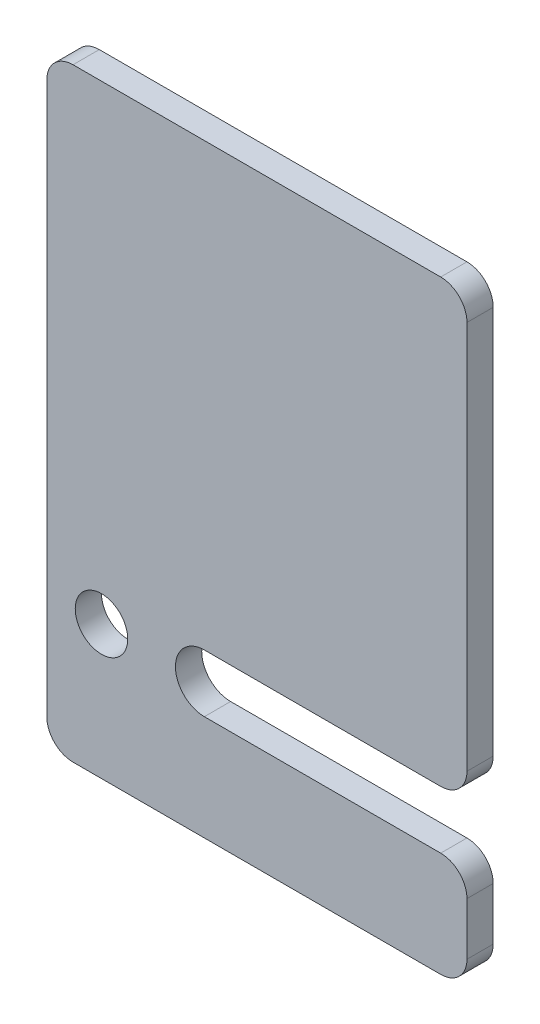
ISO-10303-21;
HEADER;
FILE_DESCRIPTION(('STEP AP214'),'2;1');
FILE_NAME('part.step','',(''),(''),'','','');
FILE_SCHEMA(('AUTOMOTIVE_DESIGN { 1 0 10303 214 1 1 1 1 }'));
ENDSEC;
DATA;
#1=APPLICATION_CONTEXT('core data for automotive mechanical design processes');
#2=APPLICATION_PROTOCOL_DEFINITION('international standard','automotive_design',2000,#1);
#3=PRODUCT_CONTEXT('',#1,'mechanical');
#4=PRODUCT('Part','Part','',(#3));
#5=PRODUCT_RELATED_PRODUCT_CATEGORY('part','',(#4));
#6=PRODUCT_DEFINITION_FORMATION('','',#4);
#7=PRODUCT_DEFINITION_CONTEXT('part definition',#1,'design');
#8=PRODUCT_DEFINITION('design','',#6,#7);
#9=PRODUCT_DEFINITION_SHAPE('','',#8);
#10=(LENGTH_UNIT() NAMED_UNIT(*) SI_UNIT(.MILLI.,.METRE.));
#11=(NAMED_UNIT(*) PLANE_ANGLE_UNIT() SI_UNIT($,.RADIAN.));
#12=(NAMED_UNIT(*) SI_UNIT($,.STERADIAN.) SOLID_ANGLE_UNIT());
#13=UNCERTAINTY_MEASURE_WITH_UNIT(LENGTH_MEASURE(1.E-05),#10,'distance_accuracy_value','');
#14=(GEOMETRIC_REPRESENTATION_CONTEXT(3) GLOBAL_UNCERTAINTY_ASSIGNED_CONTEXT((#13)) GLOBAL_UNIT_ASSIGNED_CONTEXT((#10,
#11,#12)) REPRESENTATION_CONTEXT('',''));
#15=CARTESIAN_POINT('',(0.,0.,0.));
#16=DIRECTION('',(0.,0.,1.));
#17=DIRECTION('',(1.,0.,0.));
#18=AXIS2_PLACEMENT_3D('',#15,#16,#17);
#19=CARTESIAN_POINT('',(75.,15.,5.));
#20=DIRECTION('',(0.,0.,-1.));
#21=DIRECTION('',(-1.,0.,0.));
#22=AXIS2_PLACEMENT_3D('',#19,#20,#21);
#23=CYLINDRICAL_SURFACE('',#22,5.);
#24=CARTESIAN_POINT('',(75.,15.,0.));
#25=DIRECTION('',(0.,0.,1.));
#26=DIRECTION('',(-1.,0.,0.));
#27=AXIS2_PLACEMENT_3D('',#24,#25,#26);
#28=CIRCLE('',#27,5.);
#29=CARTESIAN_POINT('',(80.,15.,0.));
#30=VERTEX_POINT('',#29);
#31=CARTESIAN_POINT('',(75.,20.,0.));
#32=VERTEX_POINT('',#31);
#33=EDGE_CURVE('E165',#30,#32,#28,.T.);
#34=ORIENTED_EDGE('',*,*,#33,.T.);
#35=DIRECTION('',(0.,0.,-1.));
#36=VECTOR('',#35,1.);
#37=CARTESIAN_POINT('',(75.,20.,5.));
#38=LINE('',#37,#36);
#39=CARTESIAN_POINT('',(75.,20.,5.));
#40=VERTEX_POINT('',#39);
#41=EDGE_CURVE('E11',#40,#32,#38,.T.);
#42=ORIENTED_EDGE('',*,*,#41,.F.);
#43=CARTESIAN_POINT('',(75.,15.,5.));
#44=DIRECTION('',(0.,0.,1.));
#45=DIRECTION('',(-1.,0.,0.));
#46=AXIS2_PLACEMENT_3D('',#43,#44,#45);
#47=CIRCLE('',#46,5.);
#48=CARTESIAN_POINT('',(80.,15.,5.));
#49=VERTEX_POINT('',#48);
#50=EDGE_CURVE('E192',#49,#40,#47,.T.);
#51=ORIENTED_EDGE('',*,*,#50,.F.);
#52=DIRECTION('',(0.,0.,-1.));
#53=VECTOR('',#52,1.);
#54=CARTESIAN_POINT('',(80.,15.,5.));
#55=LINE('',#54,#53);
#56=EDGE_CURVE('E161',#49,#30,#55,.T.);
#57=ORIENTED_EDGE('',*,*,#56,.T.);
#58=EDGE_LOOP('',(#34,#42,#51,#57));
#59=FACE_BOUND('',#58,.T.);
#60=ADVANCED_FACE('F33',(#59),#23,.T.);
#61=CARTESIAN_POINT('',(30.,20.,5.));
#62=DIRECTION('',(0.,-1.,0.));
#63=DIRECTION('',(0.,0.,-1.));
#64=AXIS2_PLACEMENT_3D('',#61,#62,#63);
#65=PLANE('',#64);
#66=DIRECTION('',(-1.,0.,0.));
#67=VECTOR('',#66,1.);
#68=CARTESIAN_POINT('',(30.,20.,0.));
#69=LINE('',#68,#67);
#70=CARTESIAN_POINT('',(30.,20.,0.));
#71=VERTEX_POINT('',#70);
#72=EDGE_CURVE('E168',#32,#71,#69,.T.);
#73=ORIENTED_EDGE('',*,*,#72,.T.);
#74=DIRECTION('',(0.,0.,-1.));
#75=VECTOR('',#74,1.);
#76=CARTESIAN_POINT('',(30.,20.,5.));
#77=LINE('',#76,#75);
#78=CARTESIAN_POINT('',(30.,20.,5.));
#79=VERTEX_POINT('',#78);
#80=EDGE_CURVE('E41',#79,#71,#77,.T.);
#81=ORIENTED_EDGE('',*,*,#80,.F.);
#82=DIRECTION('',(-1.,0.,0.));
#83=VECTOR('',#82,1.);
#84=CARTESIAN_POINT('',(30.,20.,5.));
#85=LINE('',#84,#83);
#86=EDGE_CURVE('E110',#40,#79,#85,.T.);
#87=ORIENTED_EDGE('',*,*,#86,.F.);
#88=ORIENTED_EDGE('',*,*,#41,.T.);
#89=EDGE_LOOP('',(#73,#81,#87,#88));
#90=FACE_BOUND('',#89,.T.);
#91=ADVANCED_FACE('F281',(#90),#65,.F.);
#92=CARTESIAN_POINT('',(30.,25.5,5.));
#93=DIRECTION('',(0.,0.,-1.));
#94=DIRECTION('',(-1.,0.,0.));
#95=AXIS2_PLACEMENT_3D('',#92,#93,#94);
#96=CYLINDRICAL_SURFACE('',#95,5.5);
#97=CARTESIAN_POINT('',(30.,25.5,0.));
#98=DIRECTION('',(0.,0.,-1.));
#99=DIRECTION('',(1.,0.,0.));
#100=AXIS2_PLACEMENT_3D('',#97,#98,#99);
#101=CIRCLE('',#100,5.5);
#102=CARTESIAN_POINT('',(30.,31.,0.));
#103=VERTEX_POINT('',#102);
#104=EDGE_CURVE('E171',#71,#103,#101,.T.);
#105=ORIENTED_EDGE('',*,*,#104,.T.);
#106=DIRECTION('',(0.,0.,-1.));
#107=VECTOR('',#106,1.);
#108=CARTESIAN_POINT('',(30.,31.,5.));
#109=LINE('',#108,#107);
#110=CARTESIAN_POINT('',(30.,31.,5.));
#111=VERTEX_POINT('',#110);
#112=EDGE_CURVE('E217',#111,#103,#109,.T.);
#113=ORIENTED_EDGE('',*,*,#112,.F.);
#114=CARTESIAN_POINT('',(30.,25.5,5.));
#115=DIRECTION('',(0.,0.,-1.));
#116=DIRECTION('',(1.,0.,0.));
#117=AXIS2_PLACEMENT_3D('',#114,#115,#116);
#118=CIRCLE('',#117,5.5);
#119=EDGE_CURVE('E225',#79,#111,#118,.T.);
#120=ORIENTED_EDGE('',*,*,#119,.F.);
#121=ORIENTED_EDGE('',*,*,#80,.T.);
#122=EDGE_LOOP('',(#105,#113,#120,#121));
#123=FACE_BOUND('',#122,.T.);
#124=ADVANCED_FACE('F223',(#123),#96,.F.);
#125=CARTESIAN_POINT('',(75.,31.,5.));
#126=DIRECTION('',(0.,1.,0.));
#127=DIRECTION('',(-1.,0.,0.));
#128=AXIS2_PLACEMENT_3D('',#125,#126,#127);
#129=PLANE('',#128);
#130=DIRECTION('',(1.,0.,0.));
#131=VECTOR('',#130,1.);
#132=CARTESIAN_POINT('',(75.,31.,0.));
#133=LINE('',#132,#131);
#134=CARTESIAN_POINT('',(75.,31.,0.));
#135=VERTEX_POINT('',#134);
#136=EDGE_CURVE('E173',#103,#135,#133,.T.);
#137=ORIENTED_EDGE('',*,*,#136,.T.);
#138=DIRECTION('',(0.,0.,-1.));
#139=VECTOR('',#138,1.);
#140=CARTESIAN_POINT('',(75.,31.,5.));
#141=LINE('',#140,#139);
#142=CARTESIAN_POINT('',(75.,31.,5.));
#143=VERTEX_POINT('',#142);
#144=EDGE_CURVE('E214',#143,#135,#141,.T.);
#145=ORIENTED_EDGE('',*,*,#144,.F.);
#146=DIRECTION('',(1.,0.,0.));
#147=VECTOR('',#146,1.);
#148=CARTESIAN_POINT('',(75.,31.,5.));
#149=LINE('',#148,#147);
#150=EDGE_CURVE('E243',#111,#143,#149,.T.);
#151=ORIENTED_EDGE('',*,*,#150,.F.);
#152=ORIENTED_EDGE('',*,*,#112,.T.);
#153=EDGE_LOOP('',(#137,#145,#151,#152));
#154=FACE_BOUND('',#153,.T.);
#155=ADVANCED_FACE('F234',(#154),#129,.F.);
#156=CARTESIAN_POINT('',(75.,36.,5.));
#157=DIRECTION('',(0.,0.,-1.));
#158=DIRECTION('',(-1.,0.,0.));
#159=AXIS2_PLACEMENT_3D('',#156,#157,#158);
#160=CYLINDRICAL_SURFACE('',#159,5.00000000000001);
#161=CARTESIAN_POINT('',(75.,36.,0.));
#162=DIRECTION('',(0.,0.,1.));
#163=DIRECTION('',(1.,0.,0.));
#164=AXIS2_PLACEMENT_3D('',#161,#162,#163);
#165=CIRCLE('',#164,5.00000000000001);
#166=CARTESIAN_POINT('',(80.,36.,0.));
#167=VERTEX_POINT('',#166);
#168=EDGE_CURVE('E175',#135,#167,#165,.T.);
#169=ORIENTED_EDGE('',*,*,#168,.T.);
#170=DIRECTION('',(0.,0.,-1.));
#171=VECTOR('',#170,1.);
#172=CARTESIAN_POINT('',(80.,36.,5.));
#173=LINE('',#172,#171);
#174=CARTESIAN_POINT('',(80.,36.,5.));
#175=VERTEX_POINT('',#174);
#176=EDGE_CURVE('E211',#175,#167,#173,.T.);
#177=ORIENTED_EDGE('',*,*,#176,.F.);
#178=CARTESIAN_POINT('',(75.,36.,5.));
#179=DIRECTION('',(0.,0.,1.));
#180=DIRECTION('',(1.,0.,0.));
#181=AXIS2_PLACEMENT_3D('',#178,#179,#180);
#182=CIRCLE('',#181,5.00000000000001);
#183=EDGE_CURVE('E240',#143,#175,#182,.T.);
#184=ORIENTED_EDGE('',*,*,#183,.F.);
#185=ORIENTED_EDGE('',*,*,#144,.T.);
#186=EDGE_LOOP('',(#169,#177,#184,#185));
#187=FACE_BOUND('',#186,.T.);
#188=ADVANCED_FACE('F238',(#187),#160,.T.);
#189=CARTESIAN_POINT('',(80.,110.,5.));
#190=DIRECTION('',(-1.,0.,0.));
#191=DIRECTION('',(0.,-1.,0.));
#192=AXIS2_PLACEMENT_3D('',#189,#190,#191);
#193=PLANE('',#192);
#194=DIRECTION('',(0.,1.,0.));
#195=VECTOR('',#194,1.);
#196=CARTESIAN_POINT('',(80.,110.,0.));
#197=LINE('',#196,#195);
#198=CARTESIAN_POINT('',(80.,110.,0.));
#199=VERTEX_POINT('',#198);
#200=EDGE_CURVE('E177',#167,#199,#197,.T.);
#201=ORIENTED_EDGE('',*,*,#200,.T.);
#202=DIRECTION('',(0.,0.,-1.));
#203=VECTOR('',#202,1.);
#204=CARTESIAN_POINT('',(80.,110.,5.));
#205=LINE('',#204,#203);
#206=CARTESIAN_POINT('',(80.,110.,5.));
#207=VERTEX_POINT('',#206);
#208=EDGE_CURVE('E208',#207,#199,#205,.T.);
#209=ORIENTED_EDGE('',*,*,#208,.F.);
#210=DIRECTION('',(0.,1.,0.));
#211=VECTOR('',#210,1.);
#212=CARTESIAN_POINT('',(80.,110.,5.));
#213=LINE('',#212,#211);
#214=EDGE_CURVE('E242',#175,#207,#213,.T.);
#215=ORIENTED_EDGE('',*,*,#214,.F.);
#216=ORIENTED_EDGE('',*,*,#176,.T.);
#217=EDGE_LOOP('',(#201,#209,#215,#216));
#218=FACE_BOUND('',#217,.T.);
#219=ADVANCED_FACE('F294',(#218),#193,.F.);
#220=CARTESIAN_POINT('',(75.,110.,5.));
#221=DIRECTION('',(0.,0.,-1.));
#222=DIRECTION('',(-1.,0.,0.));
#223=AXIS2_PLACEMENT_3D('',#220,#221,#222);
#224=CYLINDRICAL_SURFACE('',#223,5.);
#225=CARTESIAN_POINT('',(75.,110.,0.));
#226=DIRECTION('',(0.,0.,1.));
#227=DIRECTION('',(-1.,0.,0.));
#228=AXIS2_PLACEMENT_3D('',#225,#226,#227);
#229=CIRCLE('',#228,5.);
#230=CARTESIAN_POINT('',(75.,115.,0.));
#231=VERTEX_POINT('',#230);
#232=EDGE_CURVE('E179',#199,#231,#229,.T.);
#233=ORIENTED_EDGE('',*,*,#232,.T.);
#234=DIRECTION('',(0.,0.,-1.));
#235=VECTOR('',#234,1.);
#236=CARTESIAN_POINT('',(75.,115.,5.));
#237=LINE('',#236,#235);
#238=CARTESIAN_POINT('',(75.,115.,5.));
#239=VERTEX_POINT('',#238);
#240=EDGE_CURVE('E205',#239,#231,#237,.T.);
#241=ORIENTED_EDGE('',*,*,#240,.F.);
#242=CARTESIAN_POINT('',(75.,110.,5.));
#243=DIRECTION('',(0.,0.,1.));
#244=DIRECTION('',(-1.,0.,0.));
#245=AXIS2_PLACEMENT_3D('',#242,#243,#244);
#246=CIRCLE('',#245,5.);
#247=EDGE_CURVE('E245',#207,#239,#246,.T.);
#248=ORIENTED_EDGE('',*,*,#247,.F.);
#249=ORIENTED_EDGE('',*,*,#208,.T.);
#250=EDGE_LOOP('',(#233,#241,#248,#249));
#251=FACE_BOUND('',#250,.T.);
#252=ADVANCED_FACE('F297',(#251),#224,.T.);
#253=CARTESIAN_POINT('',(5.00000000000004,115.,5.));
#254=DIRECTION('',(0.,-1.,0.));
#255=DIRECTION('',(0.,0.,-1.));
#256=AXIS2_PLACEMENT_3D('',#253,#254,#255);
#257=PLANE('',#256);
#258=DIRECTION('',(-1.,0.,0.));
#259=VECTOR('',#258,1.);
#260=CARTESIAN_POINT('',(5.00000000000004,115.,0.));
#261=LINE('',#260,#259);
#262=CARTESIAN_POINT('',(5.00000000000004,115.,0.));
#263=VERTEX_POINT('',#262);
#264=EDGE_CURVE('E181',#231,#263,#261,.T.);
#265=ORIENTED_EDGE('',*,*,#264,.T.);
#266=DIRECTION('',(0.,0.,-1.));
#267=VECTOR('',#266,1.);
#268=CARTESIAN_POINT('',(5.00000000000004,115.,5.));
#269=LINE('',#268,#267);
#270=CARTESIAN_POINT('',(5.00000000000004,115.,5.));
#271=VERTEX_POINT('',#270);
#272=EDGE_CURVE('E202',#271,#263,#269,.T.);
#273=ORIENTED_EDGE('',*,*,#272,.F.);
#274=DIRECTION('',(-1.,0.,0.));
#275=VECTOR('',#274,1.);
#276=CARTESIAN_POINT('',(5.00000000000004,115.,5.));
#277=LINE('',#276,#275);
#278=EDGE_CURVE('E251',#239,#271,#277,.T.);
#279=ORIENTED_EDGE('',*,*,#278,.F.);
#280=ORIENTED_EDGE('',*,*,#240,.T.);
#281=EDGE_LOOP('',(#265,#273,#279,#280));
#282=FACE_BOUND('',#281,.T.);
#283=ADVANCED_FACE('F301',(#282),#257,.F.);
#284=CARTESIAN_POINT('',(5.,110.,5.));
#285=DIRECTION('',(0.,0.,-1.));
#286=DIRECTION('',(-1.,0.,0.));
#287=AXIS2_PLACEMENT_3D('',#284,#285,#286);
#288=CYLINDRICAL_SURFACE('',#287,5.);
#289=CARTESIAN_POINT('',(5.,110.,0.));
#290=DIRECTION('',(0.,0.,1.));
#291=DIRECTION('',(-1.,0.,0.));
#292=AXIS2_PLACEMENT_3D('',#289,#290,#291);
#293=CIRCLE('',#292,5.);
#294=CARTESIAN_POINT('',(0.,110.,0.));
#295=VERTEX_POINT('',#294);
#296=EDGE_CURVE('E183',#263,#295,#293,.T.);
#297=ORIENTED_EDGE('',*,*,#296,.T.);
#298=DIRECTION('',(0.,0.,-1.));
#299=VECTOR('',#298,1.);
#300=CARTESIAN_POINT('',(0.,110.,5.));
#301=LINE('',#300,#299);
#302=CARTESIAN_POINT('',(0.,110.,5.));
#303=VERTEX_POINT('',#302);
#304=EDGE_CURVE('E199',#303,#295,#301,.T.);
#305=ORIENTED_EDGE('',*,*,#304,.F.);
#306=CARTESIAN_POINT('',(5.,110.,5.));
#307=DIRECTION('',(0.,0.,1.));
#308=DIRECTION('',(-1.,0.,0.));
#309=AXIS2_PLACEMENT_3D('',#306,#307,#308);
#310=CIRCLE('',#309,5.);
#311=EDGE_CURVE('E253',#271,#303,#310,.T.);
#312=ORIENTED_EDGE('',*,*,#311,.F.);
#313=ORIENTED_EDGE('',*,*,#272,.T.);
#314=EDGE_LOOP('',(#297,#305,#312,#313));
#315=FACE_BOUND('',#314,.T.);
#316=ADVANCED_FACE('F305',(#315),#288,.T.);
#317=CARTESIAN_POINT('',(0.,5.00000000000004,5.));
#318=DIRECTION('',(1.,0.,0.));
#319=DIRECTION('',(0.,0.,-1.));
#320=AXIS2_PLACEMENT_3D('',#317,#318,#319);
#321=PLANE('',#320);
#322=DIRECTION('',(0.,-1.,0.));
#323=VECTOR('',#322,1.);
#324=CARTESIAN_POINT('',(0.,5.00000000000004,0.));
#325=LINE('',#324,#323);
#326=CARTESIAN_POINT('',(0.,5.00000000000004,0.));
#327=VERTEX_POINT('',#326);
#328=EDGE_CURVE('E185',#295,#327,#325,.T.);
#329=ORIENTED_EDGE('',*,*,#328,.T.);
#330=DIRECTION('',(0.,0.,-1.));
#331=VECTOR('',#330,1.);
#332=CARTESIAN_POINT('',(0.,5.00000000000004,5.));
#333=LINE('',#332,#331);
#334=CARTESIAN_POINT('',(0.,5.00000000000004,5.));
#335=VERTEX_POINT('',#334);
#336=EDGE_CURVE('E196',#335,#327,#333,.T.);
#337=ORIENTED_EDGE('',*,*,#336,.F.);
#338=DIRECTION('',(0.,-1.,0.));
#339=VECTOR('',#338,1.);
#340=CARTESIAN_POINT('',(0.,5.00000000000004,5.));
#341=LINE('',#340,#339);
#342=EDGE_CURVE('E255',#303,#335,#341,.T.);
#343=ORIENTED_EDGE('',*,*,#342,.F.);
#344=ORIENTED_EDGE('',*,*,#304,.T.);
#345=EDGE_LOOP('',(#329,#337,#343,#344));
#346=FACE_BOUND('',#345,.T.);
#347=ADVANCED_FACE('F261',(#346),#321,.F.);
#348=CARTESIAN_POINT('',(5.,5.,5.));
#349=DIRECTION('',(0.,0.,-1.));
#350=DIRECTION('',(-1.,0.,0.));
#351=AXIS2_PLACEMENT_3D('',#348,#349,#350);
#352=CYLINDRICAL_SURFACE('',#351,5.);
#353=CARTESIAN_POINT('',(5.,5.,0.));
#354=DIRECTION('',(0.,0.,1.));
#355=DIRECTION('',(-1.,0.,0.));
#356=AXIS2_PLACEMENT_3D('',#353,#354,#355);
#357=CIRCLE('',#356,5.);
#358=CARTESIAN_POINT('',(5.00000000000004,0.,0.));
#359=VERTEX_POINT('',#358);
#360=EDGE_CURVE('E187',#327,#359,#357,.T.);
#361=ORIENTED_EDGE('',*,*,#360,.T.);
#362=DIRECTION('',(0.,0.,-1.));
#363=VECTOR('',#362,1.);
#364=CARTESIAN_POINT('',(5.00000000000004,0.,5.));
#365=LINE('',#364,#363);
#366=CARTESIAN_POINT('',(5.00000000000004,0.,5.));
#367=VERTEX_POINT('',#366);
#368=EDGE_CURVE('E156',#367,#359,#365,.T.);
#369=ORIENTED_EDGE('',*,*,#368,.F.);
#370=CARTESIAN_POINT('',(5.,5.,5.));
#371=DIRECTION('',(0.,0.,1.));
#372=DIRECTION('',(-1.,0.,0.));
#373=AXIS2_PLACEMENT_3D('',#370,#371,#372);
#374=CIRCLE('',#373,5.);
#375=EDGE_CURVE('E147',#335,#367,#374,.T.);
#376=ORIENTED_EDGE('',*,*,#375,.F.);
#377=ORIENTED_EDGE('',*,*,#336,.T.);
#378=EDGE_LOOP('',(#361,#369,#376,#377));
#379=FACE_BOUND('',#378,.T.);
#380=ADVANCED_FACE('F265',(#379),#352,.T.);
#381=CARTESIAN_POINT('',(5.00000000000004,0.,5.));
#382=DIRECTION('',(0.,1.,0.));
#383=DIRECTION('',(0.,0.,1.));
#384=AXIS2_PLACEMENT_3D('',#381,#382,#383);
#385=PLANE('',#384);
#386=DIRECTION('',(1.,0.,0.));
#387=VECTOR('',#386,1.);
#388=CARTESIAN_POINT('',(5.00000000000004,0.,0.));
#389=LINE('',#388,#387);
#390=CARTESIAN_POINT('',(75.,0.,0.));
#391=VERTEX_POINT('',#390);
#392=EDGE_CURVE('E155',#359,#391,#389,.T.);
#393=ORIENTED_EDGE('',*,*,#392,.T.);
#394=DIRECTION('',(0.,0.,-1.));
#395=VECTOR('',#394,1.);
#396=CARTESIAN_POINT('',(75.,0.,5.));
#397=LINE('',#396,#395);
#398=CARTESIAN_POINT('',(75.,0.,5.));
#399=VERTEX_POINT('',#398);
#400=EDGE_CURVE('E152',#399,#391,#397,.T.);
#401=ORIENTED_EDGE('',*,*,#400,.F.);
#402=DIRECTION('',(1.,0.,0.));
#403=VECTOR('',#402,1.);
#404=CARTESIAN_POINT('',(5.00000000000004,0.,5.));
#405=LINE('',#404,#403);
#406=EDGE_CURVE('E141',#367,#399,#405,.T.);
#407=ORIENTED_EDGE('',*,*,#406,.F.);
#408=ORIENTED_EDGE('',*,*,#368,.T.);
#409=EDGE_LOOP('',(#393,#401,#407,#408));
#410=FACE_BOUND('',#409,.T.);
#411=ADVANCED_FACE('F153',(#410),#385,.F.);
#412=CARTESIAN_POINT('',(75.,5.,5.));
#413=DIRECTION('',(0.,0.,-1.));
#414=DIRECTION('',(-1.,0.,0.));
#415=AXIS2_PLACEMENT_3D('',#412,#413,#414);
#416=CYLINDRICAL_SURFACE('',#415,5.);
#417=CARTESIAN_POINT('',(75.,5.,0.));
#418=DIRECTION('',(0.,0.,1.));
#419=DIRECTION('',(-1.,0.,0.));
#420=AXIS2_PLACEMENT_3D('',#417,#418,#419);
#421=CIRCLE('',#420,5.);
#422=CARTESIAN_POINT('',(80.,5.00000000000004,0.));
#423=VERTEX_POINT('',#422);
#424=EDGE_CURVE('E96',#391,#423,#421,.T.);
#425=ORIENTED_EDGE('',*,*,#424,.T.);
#426=DIRECTION('',(0.,0.,-1.));
#427=VECTOR('',#426,1.);
#428=CARTESIAN_POINT('',(80.,5.00000000000004,5.));
#429=LINE('',#428,#427);
#430=CARTESIAN_POINT('',(80.,5.00000000000004,5.));
#431=VERTEX_POINT('',#430);
#432=EDGE_CURVE('E157',#431,#423,#429,.T.);
#433=ORIENTED_EDGE('',*,*,#432,.F.);
#434=CARTESIAN_POINT('',(75.,5.,5.));
#435=DIRECTION('',(0.,0.,1.));
#436=DIRECTION('',(-1.,0.,0.));
#437=AXIS2_PLACEMENT_3D('',#434,#435,#436);
#438=CIRCLE('',#437,5.);
#439=EDGE_CURVE('E145',#399,#431,#438,.T.);
#440=ORIENTED_EDGE('',*,*,#439,.F.);
#441=ORIENTED_EDGE('',*,*,#400,.T.);
#442=EDGE_LOOP('',(#425,#433,#440,#441));
#443=FACE_BOUND('',#442,.T.);
#444=ADVANCED_FACE('F159',(#443),#416,.T.);
#445=CARTESIAN_POINT('',(80.,15.,5.));
#446=DIRECTION('',(-1.,0.,0.));
#447=DIRECTION('',(0.,0.,1.));
#448=AXIS2_PLACEMENT_3D('',#445,#446,#447);
#449=PLANE('',#448);
#450=DIRECTION('',(0.,1.,0.));
#451=VECTOR('',#450,1.);
#452=CARTESIAN_POINT('',(80.,15.,0.));
#453=LINE('',#452,#451);
#454=EDGE_CURVE('E102',#423,#30,#453,.T.);
#455=ORIENTED_EDGE('',*,*,#454,.T.);
#456=ORIENTED_EDGE('',*,*,#56,.F.);
#457=DIRECTION('',(0.,1.,0.));
#458=VECTOR('',#457,1.);
#459=CARTESIAN_POINT('',(80.,15.,5.));
#460=LINE('',#459,#458);
#461=EDGE_CURVE('E49',#431,#49,#460,.T.);
#462=ORIENTED_EDGE('',*,*,#461,.F.);
#463=ORIENTED_EDGE('',*,*,#432,.T.);
#464=EDGE_LOOP('',(#455,#456,#462,#463));
#465=FACE_BOUND('',#464,.T.);
#466=ADVANCED_FACE('F269',(#465),#449,.F.);
#467=CARTESIAN_POINT('',(75.,15.,5.));
#468=DIRECTION('',(0.,0.,-1.));
#469=DIRECTION('',(-1.,0.,0.));
#470=AXIS2_PLACEMENT_3D('',#467,#468,#469);
#471=PLANE('',#470);
#472=CARTESIAN_POINT('',(10.4158271136403,25.5,5.));
#473=DIRECTION('',(0.,0.,-1.));
#474=DIRECTION('',(-1.,0.,0.));
#475=AXIS2_PLACEMENT_3D('',#472,#473,#474);
#476=CIRCLE('',#475,5.);
#477=CARTESIAN_POINT('',(5.41582711364031,25.5,5.));
#478=VERTEX_POINT('',#477);
#479=EDGE_CURVE('E169',#478,#478,#476,.T.);
#480=ORIENTED_EDGE('',*,*,#479,.T.);
#481=EDGE_LOOP('',(#480));
#482=FACE_BOUND('',#481,.T.);
#483=ORIENTED_EDGE('',*,*,#50,.T.);
#484=ORIENTED_EDGE('',*,*,#86,.T.);
#485=ORIENTED_EDGE('',*,*,#119,.T.);
#486=ORIENTED_EDGE('',*,*,#150,.T.);
#487=ORIENTED_EDGE('',*,*,#183,.T.);
#488=ORIENTED_EDGE('',*,*,#214,.T.);
#489=ORIENTED_EDGE('',*,*,#247,.T.);
#490=ORIENTED_EDGE('',*,*,#278,.T.);
#491=ORIENTED_EDGE('',*,*,#311,.T.);
#492=ORIENTED_EDGE('',*,*,#342,.T.);
#493=ORIENTED_EDGE('',*,*,#375,.T.);
#494=ORIENTED_EDGE('',*,*,#406,.T.);
#495=ORIENTED_EDGE('',*,*,#439,.T.);
#496=ORIENTED_EDGE('',*,*,#461,.T.);
#497=EDGE_LOOP('',(#483,#484,#485,#486,#487,#488,#489,#490,#491,#492,#493,#494,#495,#496));
#498=FACE_BOUND('',#497,.T.);
#499=ADVANCED_FACE('F143',(#482,#498),#471,.F.);
#500=CARTESIAN_POINT('',(75.,15.,0.));
#501=DIRECTION('',(0.,0.,-1.));
#502=DIRECTION('',(-1.,0.,0.));
#503=AXIS2_PLACEMENT_3D('',#500,#501,#502);
#504=PLANE('',#503);
#505=CARTESIAN_POINT('',(10.4158271136403,25.5,0.));
#506=DIRECTION('',(0.,0.,-1.));
#507=DIRECTION('',(-1.,0.,0.));
#508=AXIS2_PLACEMENT_3D('',#505,#506,#507);
#509=CIRCLE('',#508,5.);
#510=CARTESIAN_POINT('',(5.41582711364031,25.5,0.));
#511=VERTEX_POINT('',#510);
#512=EDGE_CURVE('E358',#511,#511,#509,.T.);
#513=ORIENTED_EDGE('',*,*,#512,.F.);
#514=EDGE_LOOP('',(#513));
#515=FACE_BOUND('',#514,.T.);
#516=ORIENTED_EDGE('',*,*,#33,.F.);
#517=ORIENTED_EDGE('',*,*,#454,.F.);
#518=ORIENTED_EDGE('',*,*,#424,.F.);
#519=ORIENTED_EDGE('',*,*,#392,.F.);
#520=ORIENTED_EDGE('',*,*,#360,.F.);
#521=ORIENTED_EDGE('',*,*,#328,.F.);
#522=ORIENTED_EDGE('',*,*,#296,.F.);
#523=ORIENTED_EDGE('',*,*,#264,.F.);
#524=ORIENTED_EDGE('',*,*,#232,.F.);
#525=ORIENTED_EDGE('',*,*,#200,.F.);
#526=ORIENTED_EDGE('',*,*,#168,.F.);
#527=ORIENTED_EDGE('',*,*,#136,.F.);
#528=ORIENTED_EDGE('',*,*,#104,.F.);
#529=ORIENTED_EDGE('',*,*,#72,.F.);
#530=EDGE_LOOP('',(#516,#517,#518,#519,#520,#521,#522,#523,#524,#525,#526,#527,#528,#529));
#531=FACE_BOUND('',#530,.T.);
#532=ADVANCED_FACE('F229',(#515,#531),#504,.T.);
#533=CARTESIAN_POINT('',(10.4158271136403,25.5,10.));
#534=DIRECTION('',(0.,0.,-1.));
#535=DIRECTION('',(-1.,0.,0.));
#536=AXIS2_PLACEMENT_3D('',#533,#534,#535);
#537=CYLINDRICAL_SURFACE('',#536,5.);
#538=ORIENTED_EDGE('',*,*,#512,.T.);
#539=EDGE_LOOP('',(#538));
#540=FACE_BOUND('',#539,.T.);
#541=ORIENTED_EDGE('',*,*,#479,.F.);
#542=EDGE_LOOP('',(#541));
#543=FACE_BOUND('',#542,.T.);
#544=ADVANCED_FACE('F342',(#540,#543),#537,.F.);
#545=CLOSED_SHELL('',(#60,#91,#124,#155,#188,#219,#252,#283,#316,#347,#380,#411,#444,#466,#499,
#532,#544));
#546=MANIFOLD_SOLID_BREP('B2',#545);
#547=ADVANCED_BREP_SHAPE_REPRESENTATION('',(#18,#546),#14);
#548=SHAPE_DEFINITION_REPRESENTATION(#9,#547);
ENDSEC;
END-ISO-10303-21;
